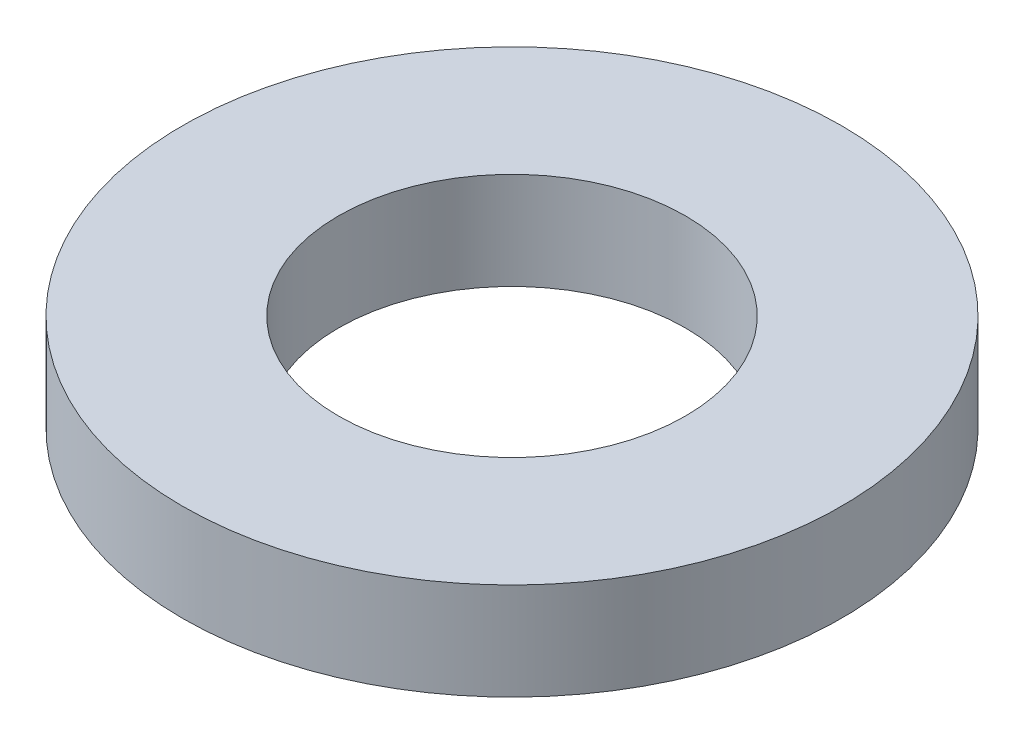
ISO-10303-21;
HEADER;
FILE_DESCRIPTION(('STEP AP214'),'2;1');
FILE_NAME('part.step','',(''),(''),'','','');
FILE_SCHEMA(('AUTOMOTIVE_DESIGN { 1 0 10303 214 1 1 1 1 }'));
ENDSEC;
DATA;
#1=APPLICATION_CONTEXT('core data for automotive mechanical design processes');
#2=APPLICATION_PROTOCOL_DEFINITION('international standard','automotive_design',2000,#1);
#3=PRODUCT_CONTEXT('',#1,'mechanical');
#4=PRODUCT('Part','Part','',(#3));
#5=PRODUCT_RELATED_PRODUCT_CATEGORY('part','',(#4));
#6=PRODUCT_DEFINITION_FORMATION('','',#4);
#7=PRODUCT_DEFINITION_CONTEXT('part definition',#1,'design');
#8=PRODUCT_DEFINITION('design','',#6,#7);
#9=PRODUCT_DEFINITION_SHAPE('','',#8);
#10=(LENGTH_UNIT() NAMED_UNIT(*) SI_UNIT(.MILLI.,.METRE.));
#11=(NAMED_UNIT(*) PLANE_ANGLE_UNIT() SI_UNIT($,.RADIAN.));
#12=(NAMED_UNIT(*) SI_UNIT($,.STERADIAN.) SOLID_ANGLE_UNIT());
#13=UNCERTAINTY_MEASURE_WITH_UNIT(LENGTH_MEASURE(1.E-05),#10,'distance_accuracy_value','');
#14=(GEOMETRIC_REPRESENTATION_CONTEXT(3) GLOBAL_UNCERTAINTY_ASSIGNED_CONTEXT((#13)) GLOBAL_UNIT_ASSIGNED_CONTEXT((#10,
#11,#12)) REPRESENTATION_CONTEXT('',''));
#15=CARTESIAN_POINT('',(0.,0.,0.));
#16=DIRECTION('',(0.,0.,1.));
#17=DIRECTION('',(1.,0.,0.));
#18=AXIS2_PLACEMENT_3D('',#15,#16,#17);
#19=CARTESIAN_POINT('',(0.,14.,0.));
#20=DIRECTION('',(0.,-1.,0.));
#21=DIRECTION('',(0.,0.,-1.));
#22=AXIS2_PLACEMENT_3D('',#19,#20,#21);
#23=CYLINDRICAL_SURFACE('',#22,47.5);
#24=CARTESIAN_POINT('',(0.,14.,0.));
#25=DIRECTION('',(0.,1.,0.));
#26=DIRECTION('',(0.,0.,1.));
#27=AXIS2_PLACEMENT_3D('',#24,#25,#26);
#28=CIRCLE('',#27,47.5);
#29=CARTESIAN_POINT('',(0.,14.,47.5));
#30=VERTEX_POINT('',#29);
#31=EDGE_CURVE('E10',#30,#30,#28,.T.);
#32=ORIENTED_EDGE('',*,*,#31,.F.);
#33=EDGE_LOOP('',(#32));
#34=FACE_BOUND('',#33,.T.);
#35=CARTESIAN_POINT('',(0.,0.,0.));
#36=DIRECTION('',(0.,1.,0.));
#37=DIRECTION('',(0.,0.,1.));
#38=AXIS2_PLACEMENT_3D('',#35,#36,#37);
#39=CIRCLE('',#38,47.5);
#40=CARTESIAN_POINT('',(0.,0.,47.5));
#41=VERTEX_POINT('',#40);
#42=EDGE_CURVE('E37',#41,#41,#39,.T.);
#43=ORIENTED_EDGE('',*,*,#42,.T.);
#44=EDGE_LOOP('',(#43));
#45=FACE_BOUND('',#44,.T.);
#46=ADVANCED_FACE('F40',(#34,#45),#23,.T.);
#47=CARTESIAN_POINT('',(0.,14.,0.));
#48=DIRECTION('',(0.,1.,0.));
#49=DIRECTION('',(0.,0.,1.));
#50=AXIS2_PLACEMENT_3D('',#47,#48,#49);
#51=PLANE('',#50);
#52=CARTESIAN_POINT('',(0.,14.,0.));
#53=DIRECTION('',(0.,1.,0.));
#54=DIRECTION('',(0.,0.,1.));
#55=AXIS2_PLACEMENT_3D('',#52,#53,#54);
#56=CIRCLE('',#55,25.);
#57=CARTESIAN_POINT('',(0.,14.,25.));
#58=VERTEX_POINT('',#57);
#59=EDGE_CURVE('E50',#58,#58,#56,.T.);
#60=ORIENTED_EDGE('',*,*,#59,.F.);
#61=EDGE_LOOP('',(#60));
#62=FACE_BOUND('',#61,.T.);
#63=ORIENTED_EDGE('',*,*,#31,.T.);
#64=EDGE_LOOP('',(#63));
#65=FACE_BOUND('',#64,.T.);
#66=ADVANCED_FACE('F59',(#62,#65),#51,.T.);
#67=CARTESIAN_POINT('',(0.,0.,0.));
#68=DIRECTION('',(0.,1.,0.));
#69=DIRECTION('',(0.,0.,1.));
#70=AXIS2_PLACEMENT_3D('',#67,#68,#69);
#71=PLANE('',#70);
#72=CARTESIAN_POINT('',(0.,0.,0.));
#73=DIRECTION('',(0.,1.,0.));
#74=DIRECTION('',(0.,0.,1.));
#75=AXIS2_PLACEMENT_3D('',#72,#73,#74);
#76=CIRCLE('',#75,25.);
#77=CARTESIAN_POINT('',(0.,0.,25.));
#78=VERTEX_POINT('',#77);
#79=EDGE_CURVE('E47',#78,#78,#76,.T.);
#80=ORIENTED_EDGE('',*,*,#79,.T.);
#81=EDGE_LOOP('',(#80));
#82=FACE_BOUND('',#81,.T.);
#83=ORIENTED_EDGE('',*,*,#42,.F.);
#84=EDGE_LOOP('',(#83));
#85=FACE_BOUND('',#84,.T.);
#86=ADVANCED_FACE('F58',(#82,#85),#71,.F.);
#87=CARTESIAN_POINT('',(0.,14.,0.));
#88=DIRECTION('',(0.,-1.,0.));
#89=DIRECTION('',(0.,0.,-1.));
#90=AXIS2_PLACEMENT_3D('',#87,#88,#89);
#91=CYLINDRICAL_SURFACE('',#90,25.);
#92=ORIENTED_EDGE('',*,*,#59,.T.);
#93=EDGE_LOOP('',(#92));
#94=FACE_BOUND('',#93,.T.);
#95=ORIENTED_EDGE('',*,*,#79,.F.);
#96=EDGE_LOOP('',(#95));
#97=FACE_BOUND('',#96,.T.);
#98=ADVANCED_FACE('F54',(#94,#97),#91,.F.);
#99=CLOSED_SHELL('',(#46,#66,#86,#98));
#100=MANIFOLD_SOLID_BREP('B2',#99);
#101=ADVANCED_BREP_SHAPE_REPRESENTATION('',(#18,#100),#14);
#102=SHAPE_DEFINITION_REPRESENTATION(#9,#101);
ENDSEC;
END-ISO-10303-21;
